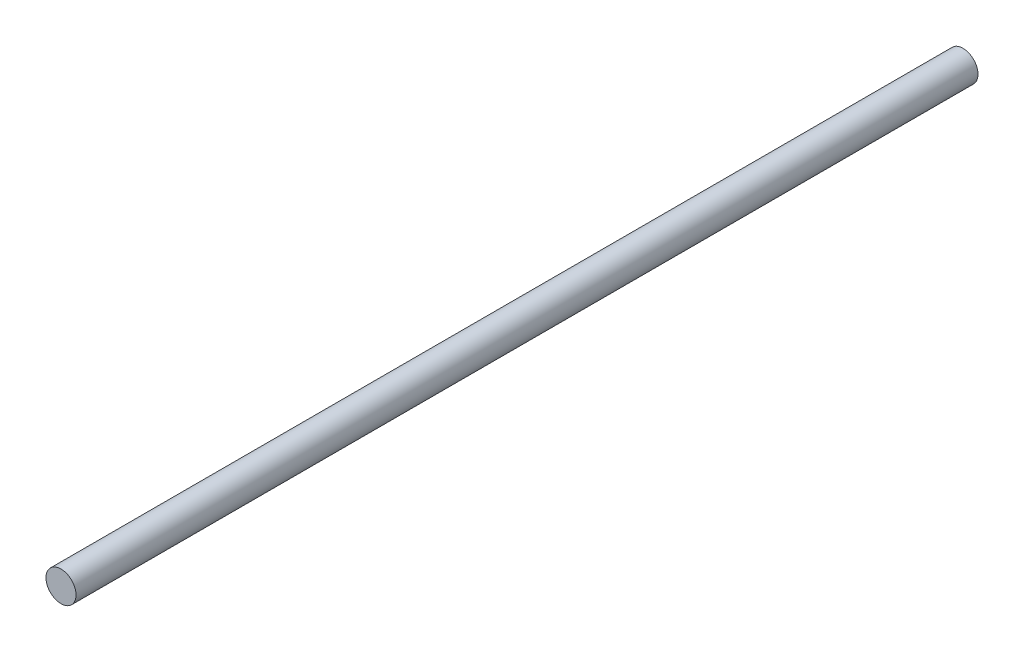
ISO-10303-21;
HEADER;
FILE_DESCRIPTION(('STEP AP214'),'2;1');
FILE_NAME('part.step','',(''),(''),'','','');
FILE_SCHEMA(('AUTOMOTIVE_DESIGN { 1 0 10303 214 1 1 1 1 }'));
ENDSEC;
DATA;
#1=APPLICATION_CONTEXT('core data for automotive mechanical design processes');
#2=APPLICATION_PROTOCOL_DEFINITION('international standard','automotive_design',2000,#1);
#3=PRODUCT_CONTEXT('',#1,'mechanical');
#4=PRODUCT('Part','Part','',(#3));
#5=PRODUCT_RELATED_PRODUCT_CATEGORY('part','',(#4));
#6=PRODUCT_DEFINITION_FORMATION('','',#4);
#7=PRODUCT_DEFINITION_CONTEXT('part definition',#1,'design');
#8=PRODUCT_DEFINITION('design','',#6,#7);
#9=PRODUCT_DEFINITION_SHAPE('','',#8);
#10=(LENGTH_UNIT() NAMED_UNIT(*) SI_UNIT(.MILLI.,.METRE.));
#11=(NAMED_UNIT(*) PLANE_ANGLE_UNIT() SI_UNIT($,.RADIAN.));
#12=(NAMED_UNIT(*) SI_UNIT($,.STERADIAN.) SOLID_ANGLE_UNIT());
#13=UNCERTAINTY_MEASURE_WITH_UNIT(LENGTH_MEASURE(1.E-05),#10,'distance_accuracy_value','');
#14=(GEOMETRIC_REPRESENTATION_CONTEXT(3) GLOBAL_UNCERTAINTY_ASSIGNED_CONTEXT((#13)) GLOBAL_UNIT_ASSIGNED_CONTEXT((#10,
#11,#12)) REPRESENTATION_CONTEXT('',''));
#15=CARTESIAN_POINT('',(0.,0.,0.));
#16=DIRECTION('',(0.,0.,1.));
#17=DIRECTION('',(1.,0.,0.));
#18=AXIS2_PLACEMENT_3D('',#15,#16,#17);
#19=CARTESIAN_POINT('',(0.,0.,90.));
#20=DIRECTION('',(0.,0.,-1.));
#21=DIRECTION('',(-1.,0.,0.));
#22=AXIS2_PLACEMENT_3D('',#19,#20,#21);
#23=CYLINDRICAL_SURFACE('',#22,1.5);
#24=CARTESIAN_POINT('',(0.,0.,90.));
#25=DIRECTION('',(0.,0.,1.));
#26=DIRECTION('',(1.,0.,0.));
#27=AXIS2_PLACEMENT_3D('',#24,#25,#26);
#28=CIRCLE('',#27,1.5);
#29=CARTESIAN_POINT('',(1.5,0.,90.));
#30=VERTEX_POINT('',#29);
#31=EDGE_CURVE('E10',#30,#30,#28,.T.);
#32=ORIENTED_EDGE('',*,*,#31,.F.);
#33=EDGE_LOOP('',(#32));
#34=FACE_BOUND('',#33,.T.);
#35=CARTESIAN_POINT('',(0.,0.,0.));
#36=DIRECTION('',(0.,0.,1.));
#37=DIRECTION('',(1.,0.,0.));
#38=AXIS2_PLACEMENT_3D('',#35,#36,#37);
#39=CIRCLE('',#38,1.5);
#40=CARTESIAN_POINT('',(1.5,0.,0.));
#41=VERTEX_POINT('',#40);
#42=EDGE_CURVE('E35',#41,#41,#39,.T.);
#43=ORIENTED_EDGE('',*,*,#42,.T.);
#44=EDGE_LOOP('',(#43));
#45=FACE_BOUND('',#44,.T.);
#46=ADVANCED_FACE('F32',(#34,#45),#23,.T.);
#47=CARTESIAN_POINT('',(0.,0.,90.));
#48=DIRECTION('',(0.,0.,1.));
#49=DIRECTION('',(1.,0.,0.));
#50=AXIS2_PLACEMENT_3D('',#47,#48,#49);
#51=PLANE('',#50);
#52=ORIENTED_EDGE('',*,*,#31,.T.);
#53=EDGE_LOOP('',(#52));
#54=FACE_BOUND('',#53,.T.);
#55=ADVANCED_FACE('F47',(#54),#51,.T.);
#56=CARTESIAN_POINT('',(0.,0.,0.));
#57=DIRECTION('',(0.,0.,1.));
#58=DIRECTION('',(1.,0.,0.));
#59=AXIS2_PLACEMENT_3D('',#56,#57,#58);
#60=PLANE('',#59);
#61=ORIENTED_EDGE('',*,*,#42,.F.);
#62=EDGE_LOOP('',(#61));
#63=FACE_BOUND('',#62,.T.);
#64=ADVANCED_FACE('F45',(#63),#60,.F.);
#65=CLOSED_SHELL('',(#46,#55,#64));
#66=MANIFOLD_SOLID_BREP('B2',#65);
#67=ADVANCED_BREP_SHAPE_REPRESENTATION('',(#18,#66),#14);
#68=SHAPE_DEFINITION_REPRESENTATION(#9,#67);
ENDSEC;
END-ISO-10303-21;
